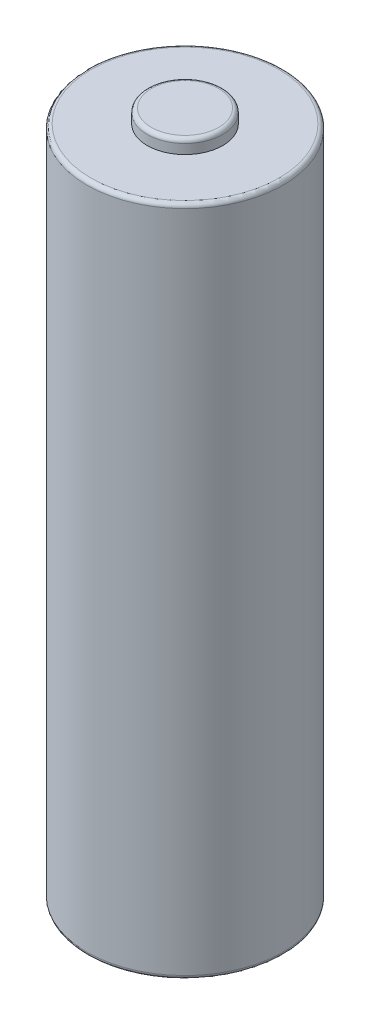
ISO-10303-21;
HEADER;
FILE_DESCRIPTION(('STEP AP214'),'2;1');
FILE_NAME('part.step','',(''),(''),'','','');
FILE_SCHEMA(('AUTOMOTIVE_DESIGN { 1 0 10303 214 1 1 1 1 }'));
ENDSEC;
DATA;
#1=APPLICATION_CONTEXT('core data for automotive mechanical design processes');
#2=APPLICATION_PROTOCOL_DEFINITION('international standard','automotive_design',2000,#1);
#3=PRODUCT_CONTEXT('',#1,'mechanical');
#4=PRODUCT('Part','Part','',(#3));
#5=PRODUCT_RELATED_PRODUCT_CATEGORY('part','',(#4));
#6=PRODUCT_DEFINITION_FORMATION('','',#4);
#7=PRODUCT_DEFINITION_CONTEXT('part definition',#1,'design');
#8=PRODUCT_DEFINITION('design','',#6,#7);
#9=PRODUCT_DEFINITION_SHAPE('','',#8);
#10=(LENGTH_UNIT() NAMED_UNIT(*) SI_UNIT(.MILLI.,.METRE.));
#11=(NAMED_UNIT(*) PLANE_ANGLE_UNIT() SI_UNIT($,.RADIAN.));
#12=(NAMED_UNIT(*) SI_UNIT($,.STERADIAN.) SOLID_ANGLE_UNIT());
#13=UNCERTAINTY_MEASURE_WITH_UNIT(LENGTH_MEASURE(1.E-05),#10,'distance_accuracy_value','');
#14=(GEOMETRIC_REPRESENTATION_CONTEXT(3) GLOBAL_UNCERTAINTY_ASSIGNED_CONTEXT((#13)) GLOBAL_UNIT_ASSIGNED_CONTEXT((#10,
#11,#12)) REPRESENTATION_CONTEXT('',''));
#15=CARTESIAN_POINT('',(0.,0.,0.));
#16=DIRECTION('',(0.,0.,1.));
#17=DIRECTION('',(1.,0.,0.));
#18=AXIS2_PLACEMENT_3D('',#15,#16,#17);
#19=CARTESIAN_POINT('',(0.,49.,0.));
#20=DIRECTION('',(0.,-1.,0.));
#21=DIRECTION('',(0.,0.,-1.));
#22=AXIS2_PLACEMENT_3D('',#19,#20,#21);
#23=CYLINDRICAL_SURFACE('',#22,7.15);
#24=CARTESIAN_POINT('',(0.,0.300000000000002,0.));
#25=DIRECTION('',(0.,1.,0.));
#26=DIRECTION('',(0.,0.,1.));
#27=AXIS2_PLACEMENT_3D('',#24,#25,#26);
#28=CIRCLE('',#27,7.15);
#29=CARTESIAN_POINT('',(0.,0.300000000000002,7.15));
#30=VERTEX_POINT('',#29);
#31=EDGE_CURVE('E62',#30,#30,#28,.T.);
#32=ORIENTED_EDGE('',*,*,#31,.T.);
#33=EDGE_LOOP('',(#32));
#34=FACE_BOUND('',#33,.T.);
#35=CARTESIAN_POINT('',(0.,48.7,0.));
#36=DIRECTION('',(0.,1.,0.));
#37=DIRECTION('',(0.,0.,1.));
#38=AXIS2_PLACEMENT_3D('',#35,#36,#37);
#39=CIRCLE('',#38,7.15);
#40=CARTESIAN_POINT('',(0.,48.7,7.15));
#41=VERTEX_POINT('',#40);
#42=EDGE_CURVE('E65',#41,#41,#39,.F.);
#43=ORIENTED_EDGE('',*,*,#42,.T.);
#44=EDGE_LOOP('',(#43));
#45=FACE_BOUND('',#44,.T.);
#46=ADVANCED_FACE('F33',(#34,#45),#23,.T.);
#47=CARTESIAN_POINT('',(0.,49.,0.));
#48=DIRECTION('',(0.,1.,0.));
#49=DIRECTION('',(0.,0.,1.));
#50=AXIS2_PLACEMENT_3D('',#47,#48,#49);
#51=PLANE('',#50);
#52=CARTESIAN_POINT('',(0.,49.,0.));
#53=DIRECTION('',(0.,1.,0.));
#54=DIRECTION('',(0.,0.,1.));
#55=AXIS2_PLACEMENT_3D('',#52,#53,#54);
#56=CIRCLE('',#55,6.85);
#57=CARTESIAN_POINT('',(0.,49.,6.85));
#58=VERTEX_POINT('',#57);
#59=EDGE_CURVE('E56',#58,#58,#56,.T.);
#60=ORIENTED_EDGE('',*,*,#59,.T.);
#61=EDGE_LOOP('',(#60));
#62=FACE_BOUND('',#61,.T.);
#63=CARTESIAN_POINT('',(0.,49.,0.));
#64=DIRECTION('',(0.,1.,0.));
#65=DIRECTION('',(0.,0.,1.));
#66=AXIS2_PLACEMENT_3D('',#63,#64,#65);
#67=CIRCLE('',#66,2.75);
#68=CARTESIAN_POINT('',(0.,49.,2.75));
#69=VERTEX_POINT('',#68);
#70=EDGE_CURVE('E68',#69,#69,#67,.T.);
#71=ORIENTED_EDGE('',*,*,#70,.F.);
#72=EDGE_LOOP('',(#71));
#73=FACE_BOUND('',#72,.T.);
#74=ADVANCED_FACE('F74',(#62,#73),#51,.T.);
#75=CARTESIAN_POINT('',(0.,0.,0.));
#76=DIRECTION('',(0.,1.,0.));
#77=DIRECTION('',(0.,0.,1.));
#78=AXIS2_PLACEMENT_3D('',#75,#76,#77);
#79=PLANE('',#78);
#80=CARTESIAN_POINT('',(0.,0.,0.));
#81=DIRECTION('',(0.,1.,0.));
#82=DIRECTION('',(0.,0.,1.));
#83=AXIS2_PLACEMENT_3D('',#80,#81,#82);
#84=CIRCLE('',#83,5.);
#85=CARTESIAN_POINT('',(0.,0.,5.));
#86=VERTEX_POINT('',#85);
#87=EDGE_CURVE('E44',#86,#86,#84,.F.);
#88=ORIENTED_EDGE('',*,*,#87,.F.);
#89=EDGE_LOOP('',(#88));
#90=FACE_BOUND('',#89,.T.);
#91=CARTESIAN_POINT('',(0.,0.,0.));
#92=DIRECTION('',(0.,1.,0.));
#93=DIRECTION('',(0.,0.,1.));
#94=AXIS2_PLACEMENT_3D('',#91,#92,#93);
#95=CIRCLE('',#94,6.85);
#96=CARTESIAN_POINT('',(0.,0.,6.85));
#97=VERTEX_POINT('',#96);
#98=EDGE_CURVE('E59',#97,#97,#95,.F.);
#99=ORIENTED_EDGE('',*,*,#98,.T.);
#100=EDGE_LOOP('',(#99));
#101=FACE_BOUND('',#100,.T.);
#102=ADVANCED_FACE('F76',(#90,#101),#79,.F.);
#103=CARTESIAN_POINT('',(0.,50.,0.));
#104=DIRECTION('',(0.,-1.,0.));
#105=DIRECTION('',(0.,0.,-1.));
#106=AXIS2_PLACEMENT_3D('',#103,#104,#105);
#107=CYLINDRICAL_SURFACE('',#106,2.75);
#108=CARTESIAN_POINT('',(0.,49.7,0.));
#109=DIRECTION('',(0.,1.,0.));
#110=DIRECTION('',(0.,0.,1.));
#111=AXIS2_PLACEMENT_3D('',#108,#109,#110);
#112=CIRCLE('',#111,2.75);
#113=CARTESIAN_POINT('',(0.,49.7,2.75));
#114=VERTEX_POINT('',#113);
#115=EDGE_CURVE('E48',#114,#114,#112,.F.);
#116=ORIENTED_EDGE('',*,*,#115,.T.);
#117=EDGE_LOOP('',(#116));
#118=FACE_BOUND('',#117,.T.);
#119=ORIENTED_EDGE('',*,*,#70,.T.);
#120=EDGE_LOOP('',(#119));
#121=FACE_BOUND('',#120,.T.);
#122=ADVANCED_FACE('F72',(#118,#121),#107,.T.);
#123=CARTESIAN_POINT('',(0.,50.,0.));
#124=DIRECTION('',(0.,1.,0.));
#125=DIRECTION('',(0.,0.,1.));
#126=AXIS2_PLACEMENT_3D('',#123,#124,#125);
#127=PLANE('',#126);
#128=CARTESIAN_POINT('',(0.,50.,0.));
#129=DIRECTION('',(0.,1.,0.));
#130=DIRECTION('',(0.,0.,1.));
#131=AXIS2_PLACEMENT_3D('',#128,#129,#130);
#132=CIRCLE('',#131,2.45);
#133=CARTESIAN_POINT('',(0.,50.,2.45));
#134=VERTEX_POINT('',#133);
#135=EDGE_CURVE('E53',#134,#134,#132,.T.);
#136=ORIENTED_EDGE('',*,*,#135,.T.);
#137=EDGE_LOOP('',(#136));
#138=FACE_BOUND('',#137,.T.);
#139=ADVANCED_FACE('F94',(#138),#127,.T.);
#140=CARTESIAN_POINT('',(0.,0.300000000000002,0.));
#141=DIRECTION('',(0.,1.,0.));
#142=DIRECTION('',(0.,0.,1.));
#143=AXIS2_PLACEMENT_3D('',#140,#141,#142);
#144=TOROIDAL_SURFACE('',#143,6.85,0.3);
#145=ORIENTED_EDGE('',*,*,#98,.F.);
#146=EDGE_LOOP('',(#145));
#147=FACE_BOUND('',#146,.T.);
#148=ORIENTED_EDGE('',*,*,#31,.F.);
#149=EDGE_LOOP('',(#148));
#150=FACE_BOUND('',#149,.T.);
#151=ADVANCED_FACE('F90',(#147,#150),#144,.T.);
#152=CARTESIAN_POINT('',(0.,48.7,0.));
#153=DIRECTION('',(0.,1.,0.));
#154=DIRECTION('',(0.,0.,1.));
#155=AXIS2_PLACEMENT_3D('',#152,#153,#154);
#156=TOROIDAL_SURFACE('',#155,6.85,0.3);
#157=ORIENTED_EDGE('',*,*,#42,.F.);
#158=EDGE_LOOP('',(#157));
#159=FACE_BOUND('',#158,.T.);
#160=ORIENTED_EDGE('',*,*,#59,.F.);
#161=EDGE_LOOP('',(#160));
#162=FACE_BOUND('',#161,.T.);
#163=ADVANCED_FACE('F93',(#159,#162),#156,.T.);
#164=CARTESIAN_POINT('',(0.,49.7,0.));
#165=DIRECTION('',(0.,1.,0.));
#166=DIRECTION('',(0.,0.,1.));
#167=AXIS2_PLACEMENT_3D('',#164,#165,#166);
#168=TOROIDAL_SURFACE('',#167,2.45,0.3);
#169=ORIENTED_EDGE('',*,*,#115,.F.);
#170=EDGE_LOOP('',(#169));
#171=FACE_BOUND('',#170,.T.);
#172=ORIENTED_EDGE('',*,*,#135,.F.);
#173=EDGE_LOOP('',(#172));
#174=FACE_BOUND('',#173,.T.);
#175=ADVANCED_FACE('F97',(#171,#174),#168,.T.);
#176=CARTESIAN_POINT('',(0.,-1.,0.));
#177=DIRECTION('',(0.,1.,0.));
#178=DIRECTION('',(0.,0.,1.));
#179=AXIS2_PLACEMENT_3D('',#176,#177,#178);
#180=CYLINDRICAL_SURFACE('',#179,5.);
#181=CARTESIAN_POINT('',(0.,-0.9,0.));
#182=DIRECTION('',(0.,-1.,0.));
#183=DIRECTION('',(0.,0.,-1.));
#184=AXIS2_PLACEMENT_3D('',#181,#182,#183);
#185=CIRCLE('',#184,5.);
#186=CARTESIAN_POINT('',(0.,-0.9,-5.));
#187=VERTEX_POINT('',#186);
#188=EDGE_CURVE('E10',#187,#187,#185,.F.);
#189=ORIENTED_EDGE('',*,*,#188,.T.);
#190=EDGE_LOOP('',(#189));
#191=FACE_BOUND('',#190,.T.);
#192=ORIENTED_EDGE('',*,*,#87,.T.);
#193=EDGE_LOOP('',(#192));
#194=FACE_BOUND('',#193,.T.);
#195=ADVANCED_FACE('F100',(#191,#194),#180,.T.);
#196=CARTESIAN_POINT('',(0.,-1.,0.));
#197=DIRECTION('',(0.,-1.,0.));
#198=DIRECTION('',(0.,0.,-1.));
#199=AXIS2_PLACEMENT_3D('',#196,#197,#198);
#200=PLANE('',#199);
#201=CARTESIAN_POINT('',(0.,-1.,0.));
#202=DIRECTION('',(0.,-1.,0.));
#203=DIRECTION('',(0.,0.,-1.));
#204=AXIS2_PLACEMENT_3D('',#201,#202,#203);
#205=CIRCLE('',#204,4.9);
#206=CARTESIAN_POINT('',(0.,-1.,-4.9));
#207=VERTEX_POINT('',#206);
#208=EDGE_CURVE('E40',#207,#207,#205,.T.);
#209=ORIENTED_EDGE('',*,*,#208,.T.);
#210=EDGE_LOOP('',(#209));
#211=FACE_BOUND('',#210,.T.);
#212=ADVANCED_FACE('F105',(#211),#200,.T.);
#213=CARTESIAN_POINT('',(0.,-0.9,0.));
#214=DIRECTION('',(0.,-1.,0.));
#215=DIRECTION('',(0.,0.,-1.));
#216=AXIS2_PLACEMENT_3D('',#213,#214,#215);
#217=TOROIDAL_SURFACE('',#216,4.9,0.1);
#218=ORIENTED_EDGE('',*,*,#188,.F.);
#219=EDGE_LOOP('',(#218));
#220=FACE_BOUND('',#219,.T.);
#221=ORIENTED_EDGE('',*,*,#208,.F.);
#222=EDGE_LOOP('',(#221));
#223=FACE_BOUND('',#222,.T.);
#224=ADVANCED_FACE('F35',(#220,#223),#217,.T.);
#225=CLOSED_SHELL('',(#46,#74,#102,#122,#139,#151,#163,#175,#195,#212,#224));
#226=MANIFOLD_SOLID_BREP('B2',#225);
#227=ADVANCED_BREP_SHAPE_REPRESENTATION('',(#18,#226),#14);
#228=SHAPE_DEFINITION_REPRESENTATION(#9,#227);
ENDSEC;
END-ISO-10303-21;
